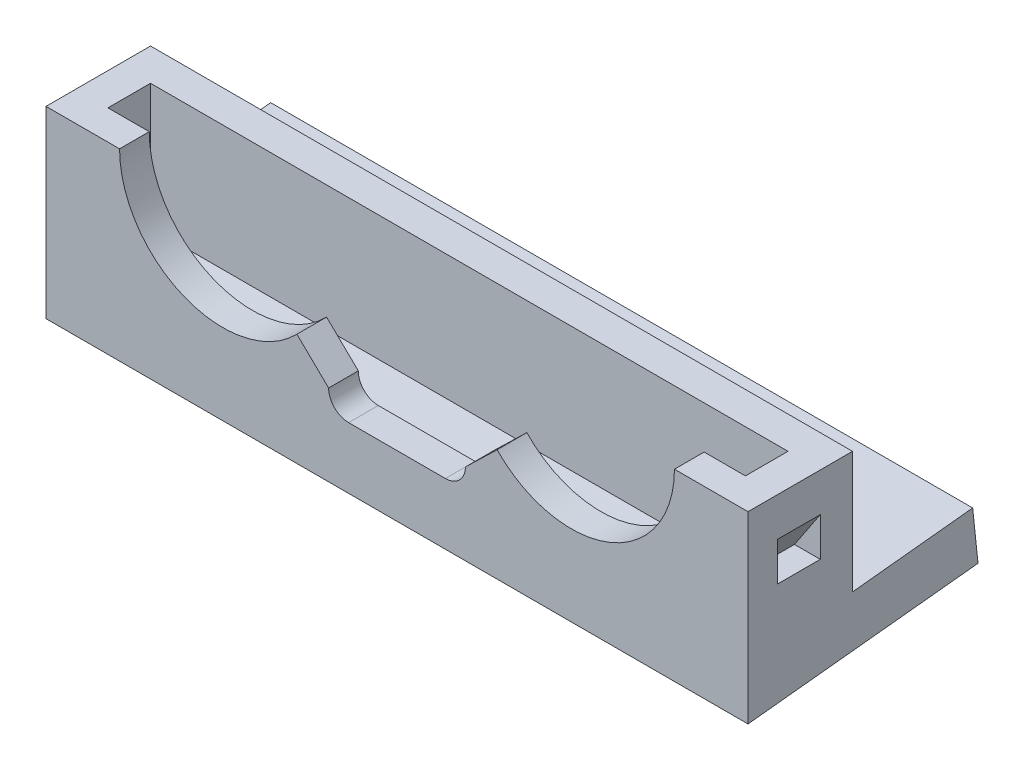
ISO-10303-21;
HEADER;
FILE_DESCRIPTION(('STEP AP214'),'2;1');
FILE_NAME('part.step','',(''),(''),'','','');
FILE_SCHEMA(('AUTOMOTIVE_DESIGN { 1 0 10303 214 1 1 1 1 }'));
ENDSEC;
DATA;
#1=APPLICATION_CONTEXT('core data for automotive mechanical design processes');
#2=APPLICATION_PROTOCOL_DEFINITION('international standard','automotive_design',2000,#1);
#3=PRODUCT_CONTEXT('',#1,'mechanical');
#4=PRODUCT('Part','Part','',(#3));
#5=PRODUCT_RELATED_PRODUCT_CATEGORY('part','',(#4));
#6=PRODUCT_DEFINITION_FORMATION('','',#4);
#7=PRODUCT_DEFINITION_CONTEXT('part definition',#1,'design');
#8=PRODUCT_DEFINITION('design','',#6,#7);
#9=PRODUCT_DEFINITION_SHAPE('','',#8);
#10=(LENGTH_UNIT() NAMED_UNIT(*) SI_UNIT(.MILLI.,.METRE.));
#11=(NAMED_UNIT(*) PLANE_ANGLE_UNIT() SI_UNIT($,.RADIAN.));
#12=(NAMED_UNIT(*) SI_UNIT($,.STERADIAN.) SOLID_ANGLE_UNIT());
#13=UNCERTAINTY_MEASURE_WITH_UNIT(LENGTH_MEASURE(1.E-05),#10,'distance_accuracy_value','');
#14=(GEOMETRIC_REPRESENTATION_CONTEXT(3) GLOBAL_UNCERTAINTY_ASSIGNED_CONTEXT((#13)) GLOBAL_UNIT_ASSIGNED_CONTEXT((#10,
#11,#12)) REPRESENTATION_CONTEXT('',''));
#15=CARTESIAN_POINT('',(0.,0.,0.));
#16=DIRECTION('',(0.,0.,1.));
#17=DIRECTION('',(1.,0.,0.));
#18=AXIS2_PLACEMENT_3D('',#15,#16,#17);
#19=CARTESIAN_POINT('',(-27.2,4.,8.));
#20=DIRECTION('',(1.,0.,0.));
#21=DIRECTION('',(0.,0.,-1.));
#22=AXIS2_PLACEMENT_3D('',#19,#20,#21);
#23=PLANE('',#22);
#24=DIRECTION('',(0.,-0.104528463267646,0.994521895368274));
#25=VECTOR('',#24,1.);
#26=CARTESIAN_POINT('',(-27.2,0.,10.3));
#27=LINE('',#26,#25);
#28=CARTESIAN_POINT('',(-27.2,1.87321147019228,-7.52241662724075));
#29=VERTEX_POINT('',#28);
#30=CARTESIAN_POINT('',(-27.2,0.,10.3));
#31=VERTEX_POINT('',#30);
#32=EDGE_CURVE('E197',#29,#31,#27,.T.);
#33=ORIENTED_EDGE('',*,*,#32,.T.);
#34=DIRECTION('',(0.,-1.,0.));
#35=VECTOR('',#34,1.);
#36=CARTESIAN_POINT('',(-27.2,0.,10.3));
#37=LINE('',#36,#35);
#38=CARTESIAN_POINT('',(-27.2,14.25,10.3));
#39=VERTEX_POINT('',#38);
#40=EDGE_CURVE('E202',#39,#31,#37,.T.);
#41=ORIENTED_EDGE('',*,*,#40,.F.);
#42=DIRECTION('',(0.,0.,-1.));
#43=VECTOR('',#42,1.);
#44=CARTESIAN_POINT('',(-27.2,14.25,8.));
#45=LINE('',#44,#43);
#46=CARTESIAN_POINT('',(-27.2,14.25,2.2));
#47=VERTEX_POINT('',#46);
#48=EDGE_CURVE('E318',#39,#47,#45,.T.);
#49=ORIENTED_EDGE('',*,*,#48,.T.);
#50=DIRECTION('',(0.,1.,0.));
#51=VECTOR('',#50,1.);
#52=CARTESIAN_POINT('',(-27.2,14.25,2.2));
#53=LINE('',#52,#51);
#54=CARTESIAN_POINT('',(-27.2,4.81536914799488,2.2));
#55=VERTEX_POINT('',#54);
#56=EDGE_CURVE('E532',#55,#47,#53,.T.);
#57=ORIENTED_EDGE('',*,*,#56,.F.);
#58=DIRECTION('',(0.,0.104528463267646,-0.994521895368274));
#59=VECTOR('',#58,1.);
#60=CARTESIAN_POINT('',(-27.2,5.79392458575725,-7.11033307353322));
#61=LINE('',#60,#59);
#62=CARTESIAN_POINT('',(-27.2,5.79392458575725,-7.11033307353322));
#63=VERTEX_POINT('',#62);
#64=EDGE_CURVE('E448',#55,#63,#61,.T.);
#65=ORIENTED_EDGE('',*,*,#64,.T.);
#66=DIRECTION('',(0.,-0.994521895368274,-0.104528463267646));
#67=VECTOR('',#66,1.);
#68=CARTESIAN_POINT('',(-27.2,1.87321147019228,-7.52241662724075));
#69=LINE('',#68,#67);
#70=EDGE_CURVE('E204',#63,#29,#69,.T.);
#71=ORIENTED_EDGE('',*,*,#70,.T.);
#72=EDGE_LOOP('',(#33,#41,#49,#57,#65,#71));
#73=FACE_BOUND('',#72,.T.);
#74=DIRECTION('',(0.,-1.,0.));
#75=VECTOR('',#74,1.);
#76=CARTESIAN_POINT('',(-27.2,11.25,8.));
#77=LINE('',#76,#75);
#78=CARTESIAN_POINT('',(-27.2,11.25,8.));
#79=VERTEX_POINT('',#78);
#80=CARTESIAN_POINT('',(-27.2,8.25,8.));
#81=VERTEX_POINT('',#80);
#82=EDGE_CURVE('E473',#79,#81,#77,.T.);
#83=ORIENTED_EDGE('',*,*,#82,.T.);
#84=DIRECTION('',(0.,0.,-1.));
#85=VECTOR('',#84,1.);
#86=CARTESIAN_POINT('',(-27.2,8.25,8.));
#87=LINE('',#86,#85);
#88=CARTESIAN_POINT('',(-27.2,8.25,4.7));
#89=VERTEX_POINT('',#88);
#90=EDGE_CURVE('E486',#81,#89,#87,.T.);
#91=ORIENTED_EDGE('',*,*,#90,.T.);
#92=DIRECTION('',(0.,-1.,0.));
#93=VECTOR('',#92,1.);
#94=CARTESIAN_POINT('',(-27.2,11.25,4.7));
#95=LINE('',#94,#93);
#96=CARTESIAN_POINT('',(-27.2,11.25,4.7));
#97=VERTEX_POINT('',#96);
#98=EDGE_CURVE('E481',#97,#89,#95,.T.);
#99=ORIENTED_EDGE('',*,*,#98,.F.);
#100=DIRECTION('',(0.,0.,-1.));
#101=VECTOR('',#100,1.);
#102=CARTESIAN_POINT('',(-27.2,11.25,8.));
#103=LINE('',#102,#101);
#104=EDGE_CURVE('E489',#79,#97,#103,.T.);
#105=ORIENTED_EDGE('',*,*,#104,.F.);
#106=EDGE_LOOP('',(#83,#91,#99,#105));
#107=FACE_BOUND('',#106,.T.);
#108=ADVANCED_FACE('F35',(#73,#107),#23,.F.);
#109=CARTESIAN_POINT('',(-27.2,0.,8.));
#110=DIRECTION('',(0.,0.,-1.));
#111=DIRECTION('',(-1.,0.,0.));
#112=AXIS2_PLACEMENT_3D('',#109,#110,#111);
#113=PLANE('',#112);
#114=DIRECTION('',(1.,0.,0.));
#115=VECTOR('',#114,1.);
#116=CARTESIAN_POINT('',(-27.2,4.205764583454,8.));
#117=LINE('',#116,#115);
#118=CARTESIAN_POINT('',(-24.7,4.205764583454,8.));
#119=VERTEX_POINT('',#118);
#120=CARTESIAN_POINT('',(24.7,4.205764583454,8.));
#121=VERTEX_POINT('',#120);
#122=EDGE_CURVE('E58',#119,#121,#117,.T.);
#123=ORIENTED_EDGE('',*,*,#122,.F.);
#124=DIRECTION('',(0.,-1.,0.));
#125=VECTOR('',#124,1.);
#126=CARTESIAN_POINT('',(-24.7,14.25,8.));
#127=LINE('',#126,#125);
#128=CARTESIAN_POINT('',(-24.7,14.25,8.));
#129=VERTEX_POINT('',#128);
#130=EDGE_CURVE('E526',#129,#119,#127,.T.);
#131=ORIENTED_EDGE('',*,*,#130,.F.);
#132=DIRECTION('',(-1.,0.,0.));
#133=VECTOR('',#132,1.);
#134=CARTESIAN_POINT('',(-27.2,14.25,8.));
#135=LINE('',#134,#133);
#136=CARTESIAN_POINT('',(-21.5,14.25,8.));
#137=VERTEX_POINT('',#136);
#138=EDGE_CURVE('E255',#137,#129,#135,.T.);
#139=ORIENTED_EDGE('',*,*,#138,.F.);
#140=CARTESIAN_POINT('',(-13.5,14.25,8.));
#141=DIRECTION('',(0.,0.,-1.));
#142=DIRECTION('',(-1.,0.,0.));
#143=AXIS2_PLACEMENT_3D('',#140,#141,#142);
#144=CIRCLE('',#143,8.);
#145=CARTESIAN_POINT('',(-7.75626648161275,8.68138030839285,8.));
#146=VERTEX_POINT('',#145);
#147=EDGE_CURVE('E242',#146,#137,#144,.T.);
#148=ORIENTED_EDGE('',*,*,#147,.F.);
#149=DIRECTION('',(-0.717966689798405,0.696077461450894,0.));
#150=VECTOR('',#149,1.);
#151=CARTESIAN_POINT('',(-13.4404373574563,14.1922532916802,8.));
#152=LINE('',#151,#150);
#153=CARTESIAN_POINT('',(-5.3,6.3,8.));
#154=VERTEX_POINT('',#153);
#155=EDGE_CURVE('E251',#154,#146,#152,.T.);
#156=ORIENTED_EDGE('',*,*,#155,.F.);
#157=CARTESIAN_POINT('',(-3.75,6.3,8.));
#158=DIRECTION('',(0.,0.,-1.));
#159=DIRECTION('',(-1.,0.,0.));
#160=AXIS2_PLACEMENT_3D('',#157,#158,#159);
#161=CIRCLE('',#160,1.55);
#162=CARTESIAN_POINT('',(-3.75,4.75,8.));
#163=VERTEX_POINT('',#162);
#164=EDGE_CURVE('E224',#163,#154,#161,.T.);
#165=ORIENTED_EDGE('',*,*,#164,.F.);
#166=DIRECTION('',(-1.,0.,0.));
#167=VECTOR('',#166,1.);
#168=CARTESIAN_POINT('',(-27.2,4.75,8.));
#169=LINE('',#168,#167);
#170=CARTESIAN_POINT('',(3.75,4.75,8.));
#171=VERTEX_POINT('',#170);
#172=EDGE_CURVE('E272',#171,#163,#169,.T.);
#173=ORIENTED_EDGE('',*,*,#172,.F.);
#174=CARTESIAN_POINT('',(3.75,6.3,8.));
#175=DIRECTION('',(0.,0.,-1.));
#176=DIRECTION('',(-1.,0.,0.));
#177=AXIS2_PLACEMENT_3D('',#174,#175,#176);
#178=CIRCLE('',#177,1.55);
#179=CARTESIAN_POINT('',(5.3,6.3,8.));
#180=VERTEX_POINT('',#179);
#181=EDGE_CURVE('E275',#180,#171,#178,.T.);
#182=ORIENTED_EDGE('',*,*,#181,.F.);
#183=DIRECTION('',(-0.717966689798406,-0.696077461450893,0.));
#184=VECTOR('',#183,1.);
#185=CARTESIAN_POINT('',(-14.601466163252,-12.9947141460797,8.));
#186=LINE('',#185,#184);
#187=CARTESIAN_POINT('',(7.75626648161275,8.68138030839285,8.));
#188=VERTEX_POINT('',#187);
#189=EDGE_CURVE('E309',#188,#180,#186,.T.);
#190=ORIENTED_EDGE('',*,*,#189,.F.);
#191=CARTESIAN_POINT('',(13.5,14.25,8.));
#192=DIRECTION('',(0.,0.,-1.));
#193=DIRECTION('',(-1.,0.,0.));
#194=AXIS2_PLACEMENT_3D('',#191,#192,#193);
#195=CIRCLE('',#194,8.00000000000001);
#196=CARTESIAN_POINT('',(21.5,14.25,8.));
#197=VERTEX_POINT('',#196);
#198=EDGE_CURVE('E260',#197,#188,#195,.T.);
#199=ORIENTED_EDGE('',*,*,#198,.F.);
#200=DIRECTION('',(-1.,0.,0.));
#201=VECTOR('',#200,1.);
#202=CARTESIAN_POINT('',(-27.2,14.25,8.));
#203=LINE('',#202,#201);
#204=CARTESIAN_POINT('',(24.7,14.25,8.));
#205=VERTEX_POINT('',#204);
#206=EDGE_CURVE('E312',#205,#197,#203,.T.);
#207=ORIENTED_EDGE('',*,*,#206,.F.);
#208=DIRECTION('',(0.,-1.,0.));
#209=VECTOR('',#208,1.);
#210=CARTESIAN_POINT('',(24.7,14.25,8.));
#211=LINE('',#210,#209);
#212=EDGE_CURVE('E521',#205,#121,#211,.T.);
#213=ORIENTED_EDGE('',*,*,#212,.T.);
#214=EDGE_LOOP('',(#123,#131,#139,#148,#156,#165,#173,#182,#190,#199,#207,#213));
#215=FACE_BOUND('',#214,.T.);
#216=ADVANCED_FACE('F249',(#215),#113,.T.);
#217=CARTESIAN_POINT('',(-27.2,14.25,4.7));
#218=DIRECTION('',(0.,0.,1.));
#219=DIRECTION('',(0.,-1.,0.));
#220=AXIS2_PLACEMENT_3D('',#217,#218,#219);
#221=PLANE('',#220);
#222=DIRECTION('',(-1.,0.,0.));
#223=VECTOR('',#222,1.);
#224=CARTESIAN_POINT('',(-27.2,4.55260855983071,4.7));
#225=LINE('',#224,#223);
#226=CARTESIAN_POINT('',(24.7,4.55260855983071,4.7));
#227=VERTEX_POINT('',#226);
#228=CARTESIAN_POINT('',(-24.7,4.55260855983071,4.7));
#229=VERTEX_POINT('',#228);
#230=EDGE_CURVE('E459',#227,#229,#225,.T.);
#231=ORIENTED_EDGE('',*,*,#230,.F.);
#232=DIRECTION('',(0.,-1.,0.));
#233=VECTOR('',#232,1.);
#234=CARTESIAN_POINT('',(24.7,14.25,4.7));
#235=LINE('',#234,#233);
#236=CARTESIAN_POINT('',(24.7,14.25,4.7));
#237=VERTEX_POINT('',#236);
#238=EDGE_CURVE('E518',#237,#227,#235,.T.);
#239=ORIENTED_EDGE('',*,*,#238,.F.);
#240=DIRECTION('',(1.,0.,0.));
#241=VECTOR('',#240,1.);
#242=CARTESIAN_POINT('',(-27.2,14.25,4.7));
#243=LINE('',#242,#241);
#244=CARTESIAN_POINT('',(-24.7,14.25,4.7));
#245=VERTEX_POINT('',#244);
#246=EDGE_CURVE('E536',#245,#237,#243,.T.);
#247=ORIENTED_EDGE('',*,*,#246,.F.);
#248=DIRECTION('',(0.,-1.,0.));
#249=VECTOR('',#248,1.);
#250=CARTESIAN_POINT('',(-24.7,14.25,4.7));
#251=LINE('',#250,#249);
#252=EDGE_CURVE('E529',#245,#229,#251,.T.);
#253=ORIENTED_EDGE('',*,*,#252,.T.);
#254=EDGE_LOOP('',(#231,#239,#247,#253));
#255=FACE_BOUND('',#254,.T.);
#256=ADVANCED_FACE('F347',(#255),#221,.T.);
#257=CARTESIAN_POINT('',(27.2,4.,8.));
#258=DIRECTION('',(-1.,0.,0.));
#259=DIRECTION('',(0.,0.,1.));
#260=AXIS2_PLACEMENT_3D('',#257,#258,#259);
#261=PLANE('',#260);
#262=DIRECTION('',(0.,0.,-1.));
#263=VECTOR('',#262,1.);
#264=CARTESIAN_POINT('',(27.2,8.25,8.));
#265=LINE('',#264,#263);
#266=CARTESIAN_POINT('',(27.2,8.25,8.));
#267=VERTEX_POINT('',#266);
#268=CARTESIAN_POINT('',(27.2,8.25,4.7));
#269=VERTEX_POINT('',#268);
#270=EDGE_CURVE('E511',#267,#269,#265,.T.);
#271=ORIENTED_EDGE('',*,*,#270,.F.);
#272=DIRECTION('',(0.,1.,0.));
#273=VECTOR('',#272,1.);
#274=CARTESIAN_POINT('',(27.2,11.25,8.));
#275=LINE('',#274,#273);
#276=CARTESIAN_POINT('',(27.2,11.25,8.));
#277=VERTEX_POINT('',#276);
#278=EDGE_CURVE('E499',#267,#277,#275,.T.);
#279=ORIENTED_EDGE('',*,*,#278,.T.);
#280=DIRECTION('',(0.,0.,-1.));
#281=VECTOR('',#280,1.);
#282=CARTESIAN_POINT('',(27.2,11.25,8.));
#283=LINE('',#282,#281);
#284=CARTESIAN_POINT('',(27.2,11.25,4.7));
#285=VERTEX_POINT('',#284);
#286=EDGE_CURVE('E502',#277,#285,#283,.T.);
#287=ORIENTED_EDGE('',*,*,#286,.T.);
#288=DIRECTION('',(0.,1.,0.));
#289=VECTOR('',#288,1.);
#290=CARTESIAN_POINT('',(27.2,11.25,4.7));
#291=LINE('',#290,#289);
#292=EDGE_CURVE('E497',#269,#285,#291,.T.);
#293=ORIENTED_EDGE('',*,*,#292,.F.);
#294=EDGE_LOOP('',(#271,#279,#287,#293));
#295=FACE_BOUND('',#294,.T.);
#296=DIRECTION('',(0.,-1.,0.));
#297=VECTOR('',#296,1.);
#298=CARTESIAN_POINT('',(27.2,0.,10.3));
#299=LINE('',#298,#297);
#300=CARTESIAN_POINT('',(27.2,14.25,10.3));
#301=VERTEX_POINT('',#300);
#302=CARTESIAN_POINT('',(27.2,0.,10.3));
#303=VERTEX_POINT('',#302);
#304=EDGE_CURVE('E222',#301,#303,#299,.T.);
#305=ORIENTED_EDGE('',*,*,#304,.T.);
#306=DIRECTION('',(0.,-0.104528463267646,0.994521895368274));
#307=VECTOR('',#306,1.);
#308=CARTESIAN_POINT('',(27.2,0.,10.3));
#309=LINE('',#308,#307);
#310=CARTESIAN_POINT('',(27.2,1.87321147019228,-7.52241662724075));
#311=VERTEX_POINT('',#310);
#312=EDGE_CURVE('E212',#311,#303,#309,.T.);
#313=ORIENTED_EDGE('',*,*,#312,.F.);
#314=DIRECTION('',(0.,-0.994521895368274,-0.104528463267646));
#315=VECTOR('',#314,1.);
#316=CARTESIAN_POINT('',(27.2,1.87321147019228,-7.52241662724075));
#317=LINE('',#316,#315);
#318=CARTESIAN_POINT('',(27.2,5.79392458575725,-7.11033307353322));
#319=VERTEX_POINT('',#318);
#320=EDGE_CURVE('E450',#319,#311,#317,.T.);
#321=ORIENTED_EDGE('',*,*,#320,.F.);
#322=DIRECTION('',(0.,0.104528463267646,-0.994521895368274));
#323=VECTOR('',#322,1.);
#324=CARTESIAN_POINT('',(27.2,5.79392458575725,-7.11033307353322));
#325=LINE('',#324,#323);
#326=CARTESIAN_POINT('',(27.2,4.81536914799488,2.2));
#327=VERTEX_POINT('',#326);
#328=EDGE_CURVE('E206',#327,#319,#325,.T.);
#329=ORIENTED_EDGE('',*,*,#328,.F.);
#330=DIRECTION('',(0.,1.,0.));
#331=VECTOR('',#330,1.);
#332=CARTESIAN_POINT('',(27.2,14.25,2.2));
#333=LINE('',#332,#331);
#334=CARTESIAN_POINT('',(27.2,14.25,2.2));
#335=VERTEX_POINT('',#334);
#336=EDGE_CURVE('E50',#327,#335,#333,.T.);
#337=ORIENTED_EDGE('',*,*,#336,.T.);
#338=DIRECTION('',(0.,0.,1.));
#339=VECTOR('',#338,1.);
#340=CARTESIAN_POINT('',(27.2,14.25,8.));
#341=LINE('',#340,#339);
#342=EDGE_CURVE('E314',#335,#301,#341,.T.);
#343=ORIENTED_EDGE('',*,*,#342,.T.);
#344=EDGE_LOOP('',(#305,#313,#321,#329,#337,#343));
#345=FACE_BOUND('',#344,.T.);
#346=ADVANCED_FACE('F37',(#295,#345),#261,.F.);
#347=CARTESIAN_POINT('',(-27.2,0.,10.3));
#348=DIRECTION('',(0.,0.,1.));
#349=DIRECTION('',(1.,0.,0.));
#350=AXIS2_PLACEMENT_3D('',#347,#348,#349);
#351=PLANE('',#350);
#352=ORIENTED_EDGE('',*,*,#40,.T.);
#353=DIRECTION('',(1.,0.,0.));
#354=VECTOR('',#353,1.);
#355=CARTESIAN_POINT('',(-27.2,0.,10.3));
#356=LINE('',#355,#354);
#357=EDGE_CURVE('E209',#31,#303,#356,.T.);
#358=ORIENTED_EDGE('',*,*,#357,.T.);
#359=ORIENTED_EDGE('',*,*,#304,.F.);
#360=DIRECTION('',(1.,0.,0.));
#361=VECTOR('',#360,1.);
#362=CARTESIAN_POINT('',(21.5,14.25,10.3));
#363=LINE('',#362,#361);
#364=CARTESIAN_POINT('',(21.5,14.25,10.3));
#365=VERTEX_POINT('',#364);
#366=EDGE_CURVE('E301',#365,#301,#363,.T.);
#367=ORIENTED_EDGE('',*,*,#366,.F.);
#368=CARTESIAN_POINT('',(13.5,14.25,10.3));
#369=DIRECTION('',(0.,0.,1.));
#370=DIRECTION('',(1.,0.,0.));
#371=AXIS2_PLACEMENT_3D('',#368,#369,#370);
#372=CIRCLE('',#371,8.00000000000001);
#373=CARTESIAN_POINT('',(7.75626648161275,8.68138030839285,10.3));
#374=VERTEX_POINT('',#373);
#375=EDGE_CURVE('E299',#374,#365,#372,.T.);
#376=ORIENTED_EDGE('',*,*,#375,.F.);
#377=DIRECTION('',(0.717966689798406,0.696077461450893,0.));
#378=VECTOR('',#377,1.);
#379=CARTESIAN_POINT('',(5.3,6.3,10.3));
#380=LINE('',#379,#378);
#381=CARTESIAN_POINT('',(5.3,6.3,10.3));
#382=VERTEX_POINT('',#381);
#383=EDGE_CURVE('E296',#382,#374,#380,.T.);
#384=ORIENTED_EDGE('',*,*,#383,.F.);
#385=CARTESIAN_POINT('',(3.75,6.3,10.3));
#386=DIRECTION('',(0.,0.,1.));
#387=DIRECTION('',(1.,0.,0.));
#388=AXIS2_PLACEMENT_3D('',#385,#386,#387);
#389=CIRCLE('',#388,1.55);
#390=CARTESIAN_POINT('',(3.75,4.75,10.3));
#391=VERTEX_POINT('',#390);
#392=EDGE_CURVE('E266',#391,#382,#389,.T.);
#393=ORIENTED_EDGE('',*,*,#392,.F.);
#394=DIRECTION('',(1.,0.,0.));
#395=VECTOR('',#394,1.);
#396=CARTESIAN_POINT('',(-3.75,4.75,10.3));
#397=LINE('',#396,#395);
#398=CARTESIAN_POINT('',(-3.75,4.75,10.3));
#399=VERTEX_POINT('',#398);
#400=EDGE_CURVE('E258',#399,#391,#397,.T.);
#401=ORIENTED_EDGE('',*,*,#400,.F.);
#402=CARTESIAN_POINT('',(-3.75,6.3,10.3));
#403=DIRECTION('',(0.,0.,1.));
#404=DIRECTION('',(1.,0.,0.));
#405=AXIS2_PLACEMENT_3D('',#402,#403,#404);
#406=CIRCLE('',#405,1.55);
#407=CARTESIAN_POINT('',(-5.3,6.3,10.3));
#408=VERTEX_POINT('',#407);
#409=EDGE_CURVE('E256',#408,#399,#406,.T.);
#410=ORIENTED_EDGE('',*,*,#409,.F.);
#411=DIRECTION('',(0.717966689798405,-0.696077461450894,0.));
#412=VECTOR('',#411,1.);
#413=CARTESIAN_POINT('',(-5.3,6.3,10.3));
#414=LINE('',#413,#412);
#415=CARTESIAN_POINT('',(-7.75626648161275,8.68138030839285,10.3));
#416=VERTEX_POINT('',#415);
#417=EDGE_CURVE('E302',#416,#408,#414,.T.);
#418=ORIENTED_EDGE('',*,*,#417,.F.);
#419=CARTESIAN_POINT('',(-13.5,14.25,10.3));
#420=DIRECTION('',(0.,0.,1.));
#421=DIRECTION('',(1.,0.,0.));
#422=AXIS2_PLACEMENT_3D('',#419,#420,#421);
#423=CIRCLE('',#422,8.);
#424=CARTESIAN_POINT('',(-21.5,14.25,10.3));
#425=VERTEX_POINT('',#424);
#426=EDGE_CURVE('E243',#425,#416,#423,.T.);
#427=ORIENTED_EDGE('',*,*,#426,.F.);
#428=DIRECTION('',(1.,0.,0.));
#429=VECTOR('',#428,1.);
#430=CARTESIAN_POINT('',(-35.2426989300947,14.25,10.3));
#431=LINE('',#430,#429);
#432=EDGE_CURVE('E221',#39,#425,#431,.T.);
#433=ORIENTED_EDGE('',*,*,#432,.F.);
#434=EDGE_LOOP('',(#352,#358,#359,#367,#376,#384,#393,#401,#410,#418,#427,#433));
#435=FACE_BOUND('',#434,.T.);
#436=ADVANCED_FACE('F219',(#435),#351,.T.);
#437=CARTESIAN_POINT('',(-3.75,6.3,0.299999999999998));
#438=DIRECTION('',(0.,0.,1.));
#439=DIRECTION('',(1.,0.,0.));
#440=AXIS2_PLACEMENT_3D('',#437,#438,#439);
#441=CYLINDRICAL_SURFACE('',#440,1.55);
#442=ORIENTED_EDGE('',*,*,#164,.T.);
#443=DIRECTION('',(0.,0.,1.));
#444=VECTOR('',#443,1.);
#445=CARTESIAN_POINT('',(-5.3,6.3,0.299999999999998));
#446=LINE('',#445,#444);
#447=EDGE_CURVE('E284',#154,#408,#446,.T.);
#448=ORIENTED_EDGE('',*,*,#447,.T.);
#449=ORIENTED_EDGE('',*,*,#409,.T.);
#450=DIRECTION('',(0.,0.,1.));
#451=VECTOR('',#450,1.);
#452=CARTESIAN_POINT('',(-3.75,4.75,0.299999999999998));
#453=LINE('',#452,#451);
#454=EDGE_CURVE('E269',#163,#399,#453,.T.);
#455=ORIENTED_EDGE('',*,*,#454,.F.);
#456=EDGE_LOOP('',(#442,#448,#449,#455));
#457=FACE_BOUND('',#456,.T.);
#458=ADVANCED_FACE('F283',(#457),#441,.F.);
#459=CARTESIAN_POINT('',(3.75,6.3,0.299999999999998));
#460=DIRECTION('',(0.,0.,1.));
#461=DIRECTION('',(1.,0.,0.));
#462=AXIS2_PLACEMENT_3D('',#459,#460,#461);
#463=CYLINDRICAL_SURFACE('',#462,1.55);
#464=ORIENTED_EDGE('',*,*,#392,.T.);
#465=DIRECTION('',(0.,0.,1.));
#466=VECTOR('',#465,1.);
#467=CARTESIAN_POINT('',(5.3,6.3,0.299999999999998));
#468=LINE('',#467,#466);
#469=EDGE_CURVE('E293',#180,#382,#468,.T.);
#470=ORIENTED_EDGE('',*,*,#469,.F.);
#471=ORIENTED_EDGE('',*,*,#181,.T.);
#472=DIRECTION('',(0.,0.,1.));
#473=VECTOR('',#472,1.);
#474=CARTESIAN_POINT('',(3.75,4.75,0.299999999999998));
#475=LINE('',#474,#473);
#476=EDGE_CURVE('E270',#171,#391,#475,.T.);
#477=ORIENTED_EDGE('',*,*,#476,.T.);
#478=EDGE_LOOP('',(#464,#470,#471,#477));
#479=FACE_BOUND('',#478,.T.);
#480=ADVANCED_FACE('F292',(#479),#463,.F.);
#481=CARTESIAN_POINT('',(-3.75,4.75,0.299999999999998));
#482=DIRECTION('',(0.,-1.,0.));
#483=DIRECTION('',(1.,0.,0.));
#484=AXIS2_PLACEMENT_3D('',#481,#482,#483);
#485=PLANE('',#484);
#486=ORIENTED_EDGE('',*,*,#172,.T.);
#487=ORIENTED_EDGE('',*,*,#454,.T.);
#488=ORIENTED_EDGE('',*,*,#400,.T.);
#489=ORIENTED_EDGE('',*,*,#476,.F.);
#490=EDGE_LOOP('',(#486,#487,#488,#489));
#491=FACE_BOUND('',#490,.T.);
#492=ADVANCED_FACE('F289',(#491),#485,.F.);
#493=CARTESIAN_POINT('',(-13.5,14.25,0.299999999999998));
#494=DIRECTION('',(0.,0.,1.));
#495=DIRECTION('',(1.,0.,0.));
#496=AXIS2_PLACEMENT_3D('',#493,#494,#495);
#497=CYLINDRICAL_SURFACE('',#496,8.);
#498=ORIENTED_EDGE('',*,*,#426,.T.);
#499=DIRECTION('',(0.,0.,1.));
#500=VECTOR('',#499,1.);
#501=CARTESIAN_POINT('',(-7.75626648161275,8.68138030839285,0.299999999999998));
#502=LINE('',#501,#500);
#503=EDGE_CURVE('E43',#416,#146,#502,.F.);
#504=ORIENTED_EDGE('',*,*,#503,.T.);
#505=ORIENTED_EDGE('',*,*,#147,.T.);
#506=DIRECTION('',(0.,0.,1.));
#507=VECTOR('',#506,1.);
#508=CARTESIAN_POINT('',(-21.5,14.25,0.299999999999998));
#509=LINE('',#508,#507);
#510=EDGE_CURVE('E234',#137,#425,#509,.T.);
#511=ORIENTED_EDGE('',*,*,#510,.T.);
#512=EDGE_LOOP('',(#498,#504,#505,#511));
#513=FACE_BOUND('',#512,.T.);
#514=ADVANCED_FACE('F241',(#513),#497,.F.);
#515=CARTESIAN_POINT('',(13.5,14.25,0.299999999999998));
#516=DIRECTION('',(0.,0.,1.));
#517=DIRECTION('',(1.,0.,0.));
#518=AXIS2_PLACEMENT_3D('',#515,#516,#517);
#519=CYLINDRICAL_SURFACE('',#518,8.00000000000001);
#520=ORIENTED_EDGE('',*,*,#375,.T.);
#521=DIRECTION('',(0.,0.,1.));
#522=VECTOR('',#521,1.);
#523=CARTESIAN_POINT('',(21.5,14.25,0.299999999999998));
#524=LINE('',#523,#522);
#525=EDGE_CURVE('E231',#365,#197,#524,.F.);
#526=ORIENTED_EDGE('',*,*,#525,.T.);
#527=ORIENTED_EDGE('',*,*,#198,.T.);
#528=DIRECTION('',(0.,0.,1.));
#529=VECTOR('',#528,1.);
#530=CARTESIAN_POINT('',(7.75626648161275,8.68138030839285,0.299999999999998));
#531=LINE('',#530,#529);
#532=EDGE_CURVE('E216',#188,#374,#531,.T.);
#533=ORIENTED_EDGE('',*,*,#532,.T.);
#534=EDGE_LOOP('',(#520,#526,#527,#533));
#535=FACE_BOUND('',#534,.T.);
#536=ADVANCED_FACE('F324',(#535),#519,.F.);
#537=CARTESIAN_POINT('',(5.3,6.3,0.299999999999998));
#538=DIRECTION('',(0.696077461450893,-0.717966689798406,0.));
#539=DIRECTION('',(0.717966689798406,0.696077461450893,0.));
#540=AXIS2_PLACEMENT_3D('',#537,#538,#539);
#541=PLANE('',#540);
#542=ORIENTED_EDGE('',*,*,#189,.T.);
#543=ORIENTED_EDGE('',*,*,#469,.T.);
#544=ORIENTED_EDGE('',*,*,#383,.T.);
#545=ORIENTED_EDGE('',*,*,#532,.F.);
#546=EDGE_LOOP('',(#542,#543,#544,#545));
#547=FACE_BOUND('',#546,.T.);
#548=ADVANCED_FACE('F327',(#547),#541,.F.);
#549=CARTESIAN_POINT('',(-35.2426989300947,14.25,0.299999999999998));
#550=DIRECTION('',(0.,-1.,0.));
#551=DIRECTION('',(0.,0.,-1.));
#552=AXIS2_PLACEMENT_3D('',#549,#550,#551);
#553=PLANE('',#552);
#554=ORIENTED_EDGE('',*,*,#432,.T.);
#555=ORIENTED_EDGE('',*,*,#510,.F.);
#556=ORIENTED_EDGE('',*,*,#138,.T.);
#557=DIRECTION('',(0.,0.,-1.));
#558=VECTOR('',#557,1.);
#559=CARTESIAN_POINT('',(-24.7,14.25,4.7));
#560=LINE('',#559,#558);
#561=EDGE_CURVE('E523',#129,#245,#560,.T.);
#562=ORIENTED_EDGE('',*,*,#561,.T.);
#563=ORIENTED_EDGE('',*,*,#246,.T.);
#564=DIRECTION('',(0.,0.,1.));
#565=VECTOR('',#564,1.);
#566=CARTESIAN_POINT('',(24.7,14.25,4.7));
#567=LINE('',#566,#565);
#568=EDGE_CURVE('E516',#237,#205,#567,.T.);
#569=ORIENTED_EDGE('',*,*,#568,.T.);
#570=ORIENTED_EDGE('',*,*,#206,.T.);
#571=ORIENTED_EDGE('',*,*,#525,.F.);
#572=ORIENTED_EDGE('',*,*,#366,.T.);
#573=ORIENTED_EDGE('',*,*,#342,.F.);
#574=DIRECTION('',(1.,0.,0.));
#575=VECTOR('',#574,1.);
#576=CARTESIAN_POINT('',(-27.2,14.25,2.2));
#577=LINE('',#576,#575);
#578=EDGE_CURVE('E534',#47,#335,#577,.T.);
#579=ORIENTED_EDGE('',*,*,#578,.F.);
#580=ORIENTED_EDGE('',*,*,#48,.F.);
#581=EDGE_LOOP('',(#554,#555,#556,#562,#563,#569,#570,#571,#572,#573,#579,#580));
#582=FACE_BOUND('',#581,.T.);
#583=ADVANCED_FACE('F329',(#582),#553,.F.);
#584=CARTESIAN_POINT('',(-5.3,6.3,0.299999999999998));
#585=DIRECTION('',(-0.696077461450894,-0.717966689798405,0.));
#586=DIRECTION('',(0.717966689798405,-0.696077461450894,0.));
#587=AXIS2_PLACEMENT_3D('',#584,#585,#586);
#588=PLANE('',#587);
#589=ORIENTED_EDGE('',*,*,#155,.T.);
#590=ORIENTED_EDGE('',*,*,#503,.F.);
#591=ORIENTED_EDGE('',*,*,#417,.T.);
#592=ORIENTED_EDGE('',*,*,#447,.F.);
#593=EDGE_LOOP('',(#589,#590,#591,#592));
#594=FACE_BOUND('',#593,.T.);
#595=ADVANCED_FACE('F335',(#594),#588,.F.);
#596=CARTESIAN_POINT('',(-27.2,14.25,2.2));
#597=DIRECTION('',(0.,0.,-1.));
#598=DIRECTION('',(0.,1.,0.));
#599=AXIS2_PLACEMENT_3D('',#596,#597,#598);
#600=PLANE('',#599);
#601=DIRECTION('',(1.,0.,0.));
#602=VECTOR('',#601,1.);
#603=CARTESIAN_POINT('',(-27.2,4.81536914799488,2.2));
#604=LINE('',#603,#602);
#605=EDGE_CURVE('E467',#55,#327,#604,.T.);
#606=ORIENTED_EDGE('',*,*,#605,.F.);
#607=ORIENTED_EDGE('',*,*,#56,.T.);
#608=ORIENTED_EDGE('',*,*,#578,.T.);
#609=ORIENTED_EDGE('',*,*,#336,.F.);
#610=EDGE_LOOP('',(#606,#607,#608,#609));
#611=FACE_BOUND('',#610,.T.);
#612=ADVANCED_FACE('F360',(#611),#600,.T.);
#613=CARTESIAN_POINT('',(-24.7,14.25,4.7));
#614=DIRECTION('',(-1.,0.,0.));
#615=DIRECTION('',(0.,0.,1.));
#616=AXIS2_PLACEMENT_3D('',#613,#614,#615);
#617=PLANE('',#616);
#618=ORIENTED_EDGE('',*,*,#130,.T.);
#619=DIRECTION('',(0.,0.104528463267646,-0.994521895368274));
#620=VECTOR('',#619,1.);
#621=CARTESIAN_POINT('',(-24.7,4.65856419462627,3.69189947457644));
#622=LINE('',#621,#620);
#623=EDGE_CURVE('E464',#119,#229,#622,.T.);
#624=ORIENTED_EDGE('',*,*,#623,.T.);
#625=ORIENTED_EDGE('',*,*,#252,.F.);
#626=ORIENTED_EDGE('',*,*,#561,.F.);
#627=EDGE_LOOP('',(#618,#624,#625,#626));
#628=FACE_BOUND('',#627,.T.);
#629=ADVANCED_FACE('F365',(#628),#617,.F.);
#630=CARTESIAN_POINT('',(24.7,14.25,4.7));
#631=DIRECTION('',(1.,0.,0.));
#632=DIRECTION('',(0.,0.,-1.));
#633=AXIS2_PLACEMENT_3D('',#630,#631,#632);
#634=PLANE('',#633);
#635=ORIENTED_EDGE('',*,*,#238,.T.);
#636=DIRECTION('',(0.,-0.104528463267646,0.994521895368274));
#637=VECTOR('',#636,1.);
#638=CARTESIAN_POINT('',(24.7,4.65856419462627,3.69189947457644));
#639=LINE('',#638,#637);
#640=EDGE_CURVE('E11',#227,#121,#639,.T.);
#641=ORIENTED_EDGE('',*,*,#640,.T.);
#642=ORIENTED_EDGE('',*,*,#212,.F.);
#643=ORIENTED_EDGE('',*,*,#568,.F.);
#644=EDGE_LOOP('',(#635,#641,#642,#643));
#645=FACE_BOUND('',#644,.T.);
#646=ADVANCED_FACE('F370',(#645),#634,.F.);
#647=CARTESIAN_POINT('',(25.2,8.25,8.));
#648=DIRECTION('',(0.832050294337844,-0.554700196225229,0.));
#649=DIRECTION('',(0.554700196225229,0.832050294337844,0.));
#650=AXIS2_PLACEMENT_3D('',#647,#648,#649);
#651=PLANE('',#650);
#652=DIRECTION('',(-0.554700196225229,-0.832050294337844,0.));
#653=VECTOR('',#652,1.);
#654=CARTESIAN_POINT('',(25.2,8.25,4.7));
#655=LINE('',#654,#653);
#656=CARTESIAN_POINT('',(25.2,8.25,4.7));
#657=VERTEX_POINT('',#656);
#658=EDGE_CURVE('E492',#285,#657,#655,.T.);
#659=ORIENTED_EDGE('',*,*,#658,.F.);
#660=ORIENTED_EDGE('',*,*,#286,.F.);
#661=DIRECTION('',(-0.554700196225229,-0.832050294337844,0.));
#662=VECTOR('',#661,1.);
#663=CARTESIAN_POINT('',(25.2,8.25,8.));
#664=LINE('',#663,#662);
#665=CARTESIAN_POINT('',(25.2,8.25,8.));
#666=VERTEX_POINT('',#665);
#667=EDGE_CURVE('E493',#277,#666,#664,.T.);
#668=ORIENTED_EDGE('',*,*,#667,.T.);
#669=DIRECTION('',(0.,0.,-1.));
#670=VECTOR('',#669,1.);
#671=CARTESIAN_POINT('',(25.2,8.25,8.));
#672=LINE('',#671,#670);
#673=EDGE_CURVE('E513',#666,#657,#672,.T.);
#674=ORIENTED_EDGE('',*,*,#673,.T.);
#675=EDGE_LOOP('',(#659,#660,#668,#674));
#676=FACE_BOUND('',#675,.T.);
#677=ADVANCED_FACE('F379',(#676),#651,.T.);
#678=CARTESIAN_POINT('',(27.2,8.25,8.));
#679=DIRECTION('',(0.,1.,0.));
#680=DIRECTION('',(0.,0.,1.));
#681=AXIS2_PLACEMENT_3D('',#678,#679,#680);
#682=PLANE('',#681);
#683=DIRECTION('',(1.,0.,0.));
#684=VECTOR('',#683,1.);
#685=CARTESIAN_POINT('',(27.2,8.25,4.7));
#686=LINE('',#685,#684);
#687=EDGE_CURVE('E505',#657,#269,#686,.T.);
#688=ORIENTED_EDGE('',*,*,#687,.F.);
#689=ORIENTED_EDGE('',*,*,#673,.F.);
#690=DIRECTION('',(1.,0.,0.));
#691=VECTOR('',#690,1.);
#692=CARTESIAN_POINT('',(27.2,8.25,8.));
#693=LINE('',#692,#691);
#694=EDGE_CURVE('E496',#666,#267,#693,.T.);
#695=ORIENTED_EDGE('',*,*,#694,.T.);
#696=ORIENTED_EDGE('',*,*,#270,.T.);
#697=EDGE_LOOP('',(#688,#689,#695,#696));
#698=FACE_BOUND('',#697,.T.);
#699=ADVANCED_FACE('F383',(#698),#682,.T.);
#700=CARTESIAN_POINT('',(0.,0.,8.));
#701=DIRECTION('',(0.,0.,1.));
#702=DIRECTION('',(1.,0.,0.));
#703=AXIS2_PLACEMENT_3D('',#700,#701,#702);
#704=PLANE('',#703);
#705=ORIENTED_EDGE('',*,*,#667,.F.);
#706=ORIENTED_EDGE('',*,*,#278,.F.);
#707=ORIENTED_EDGE('',*,*,#694,.F.);
#708=EDGE_LOOP('',(#705,#706,#707));
#709=FACE_BOUND('',#708,.T.);
#710=ADVANCED_FACE('F387',(#709),#704,.F.);
#711=CARTESIAN_POINT('',(0.,0.,4.7));
#712=DIRECTION('',(0.,0.,1.));
#713=DIRECTION('',(1.,0.,0.));
#714=AXIS2_PLACEMENT_3D('',#711,#712,#713);
#715=PLANE('',#714);
#716=ORIENTED_EDGE('',*,*,#658,.T.);
#717=ORIENTED_EDGE('',*,*,#687,.T.);
#718=ORIENTED_EDGE('',*,*,#292,.T.);
#719=EDGE_LOOP('',(#716,#717,#718));
#720=FACE_BOUND('',#719,.T.);
#721=ADVANCED_FACE('F389',(#720),#715,.T.);
#722=CARTESIAN_POINT('',(-25.2,8.25,8.));
#723=DIRECTION('',(-0.832050294337844,-0.554700196225229,0.));
#724=DIRECTION('',(0.554700196225229,-0.832050294337844,0.));
#725=AXIS2_PLACEMENT_3D('',#722,#723,#724);
#726=PLANE('',#725);
#727=DIRECTION('',(-0.554700196225229,0.832050294337844,0.));
#728=VECTOR('',#727,1.);
#729=CARTESIAN_POINT('',(-25.2,8.25,4.7));
#730=LINE('',#729,#728);
#731=CARTESIAN_POINT('',(-25.2,8.25,4.7));
#732=VERTEX_POINT('',#731);
#733=EDGE_CURVE('E469',#732,#97,#730,.T.);
#734=ORIENTED_EDGE('',*,*,#733,.F.);
#735=DIRECTION('',(0.,0.,-1.));
#736=VECTOR('',#735,1.);
#737=CARTESIAN_POINT('',(-25.2,8.25,8.));
#738=LINE('',#737,#736);
#739=CARTESIAN_POINT('',(-25.2,8.25,8.));
#740=VERTEX_POINT('',#739);
#741=EDGE_CURVE('E479',#740,#732,#738,.T.);
#742=ORIENTED_EDGE('',*,*,#741,.F.);
#743=DIRECTION('',(-0.554700196225229,0.832050294337844,0.));
#744=VECTOR('',#743,1.);
#745=CARTESIAN_POINT('',(-25.2,8.25,8.));
#746=LINE('',#745,#744);
#747=EDGE_CURVE('E470',#740,#79,#746,.T.);
#748=ORIENTED_EDGE('',*,*,#747,.T.);
#749=ORIENTED_EDGE('',*,*,#104,.T.);
#750=EDGE_LOOP('',(#734,#742,#748,#749));
#751=FACE_BOUND('',#750,.T.);
#752=ADVANCED_FACE('F392',(#751),#726,.T.);
#753=CARTESIAN_POINT('',(-27.2,8.25,8.));
#754=DIRECTION('',(0.,1.,0.));
#755=DIRECTION('',(0.,0.,1.));
#756=AXIS2_PLACEMENT_3D('',#753,#754,#755);
#757=PLANE('',#756);
#758=DIRECTION('',(1.,0.,0.));
#759=VECTOR('',#758,1.);
#760=CARTESIAN_POINT('',(-27.2,8.25,4.7));
#761=LINE('',#760,#759);
#762=EDGE_CURVE('E474',#89,#732,#761,.T.);
#763=ORIENTED_EDGE('',*,*,#762,.F.);
#764=ORIENTED_EDGE('',*,*,#90,.F.);
#765=DIRECTION('',(1.,0.,0.));
#766=VECTOR('',#765,1.);
#767=CARTESIAN_POINT('',(-27.2,8.25,8.));
#768=LINE('',#767,#766);
#769=EDGE_CURVE('E477',#81,#740,#768,.T.);
#770=ORIENTED_EDGE('',*,*,#769,.T.);
#771=ORIENTED_EDGE('',*,*,#741,.T.);
#772=EDGE_LOOP('',(#763,#764,#770,#771));
#773=FACE_BOUND('',#772,.T.);
#774=ADVANCED_FACE('F399',(#773),#757,.T.);
#775=CARTESIAN_POINT('',(0.,0.,8.));
#776=DIRECTION('',(0.,0.,-1.));
#777=DIRECTION('',(-1.,0.,0.));
#778=AXIS2_PLACEMENT_3D('',#775,#776,#777);
#779=PLANE('',#778);
#780=ORIENTED_EDGE('',*,*,#747,.F.);
#781=ORIENTED_EDGE('',*,*,#769,.F.);
#782=ORIENTED_EDGE('',*,*,#82,.F.);
#783=EDGE_LOOP('',(#780,#781,#782));
#784=FACE_BOUND('',#783,.T.);
#785=ADVANCED_FACE('F403',(#784),#779,.T.);
#786=CARTESIAN_POINT('',(0.,0.,4.7));
#787=DIRECTION('',(0.,0.,-1.));
#788=DIRECTION('',(-1.,0.,0.));
#789=AXIS2_PLACEMENT_3D('',#786,#787,#788);
#790=PLANE('',#789);
#791=ORIENTED_EDGE('',*,*,#733,.T.);
#792=ORIENTED_EDGE('',*,*,#98,.T.);
#793=ORIENTED_EDGE('',*,*,#762,.T.);
#794=EDGE_LOOP('',(#791,#792,#793));
#795=FACE_BOUND('',#794,.T.);
#796=ADVANCED_FACE('F405',(#795),#790,.F.);
#797=CARTESIAN_POINT('',(27.2,5.79392458575725,-7.11033307353322));
#798=DIRECTION('',(0.,0.994521895368274,0.104528463267646));
#799=DIRECTION('',(0.,-0.104528463267646,0.994521895368274));
#800=AXIS2_PLACEMENT_3D('',#797,#798,#799);
#801=PLANE('',#800);
#802=ORIENTED_EDGE('',*,*,#623,.F.);
#803=ORIENTED_EDGE('',*,*,#122,.T.);
#804=ORIENTED_EDGE('',*,*,#640,.F.);
#805=ORIENTED_EDGE('',*,*,#230,.T.);
#806=EDGE_LOOP('',(#802,#803,#804,#805));
#807=FACE_BOUND('',#806,.T.);
#808=ADVANCED_FACE('F407',(#807),#801,.T.);
#809=CARTESIAN_POINT('',(27.2,0.,10.3));
#810=DIRECTION('',(0.,-0.994521895368274,-0.104528463267646));
#811=DIRECTION('',(0.,0.104528463267646,-0.994521895368274));
#812=AXIS2_PLACEMENT_3D('',#809,#810,#811);
#813=PLANE('',#812);
#814=CARTESIAN_POINT('',(13.5,1.37433961976594,-2.77596802633187));
#815=DIRECTION('',(0.,-0.994521895368274,-0.104528463267646));
#816=DIRECTION('',(0.,0.104528463267646,-0.994521895368274));
#817=AXIS2_PLACEMENT_3D('',#814,#815,#816);
#818=CIRCLE('',#817,2.3);
#819=CARTESIAN_POINT('',(13.5,1.61475508528153,-5.0633683856789));
#820=VERTEX_POINT('',#819);
#821=EDGE_CURVE('E435',#820,#820,#818,.T.);
#822=ORIENTED_EDGE('',*,*,#821,.F.);
#823=EDGE_LOOP('',(#822));
#824=FACE_BOUND('',#823,.T.);
#825=CARTESIAN_POINT('',(-13.5,1.37433961976594,-2.77596802633187));
#826=DIRECTION('',(0.,-0.994521895368274,-0.104528463267646));
#827=DIRECTION('',(0.,0.104528463267646,-0.994521895368274));
#828=AXIS2_PLACEMENT_3D('',#825,#826,#827);
#829=CIRCLE('',#828,2.3);
#830=CARTESIAN_POINT('',(-13.5,1.61475508528153,-5.0633683856789));
#831=VERTEX_POINT('',#830);
#832=EDGE_CURVE('E445',#831,#831,#829,.T.);
#833=ORIENTED_EDGE('',*,*,#832,.F.);
#834=EDGE_LOOP('',(#833));
#835=FACE_BOUND('',#834,.T.);
#836=ORIENTED_EDGE('',*,*,#312,.T.);
#837=ORIENTED_EDGE('',*,*,#357,.F.);
#838=ORIENTED_EDGE('',*,*,#32,.F.);
#839=DIRECTION('',(-1.,0.,0.));
#840=VECTOR('',#839,1.);
#841=CARTESIAN_POINT('',(27.2,1.87321147019228,-7.52241662724075));
#842=LINE('',#841,#840);
#843=EDGE_CURVE('E457',#311,#29,#842,.T.);
#844=ORIENTED_EDGE('',*,*,#843,.F.);
#845=EDGE_LOOP('',(#836,#837,#838,#844));
#846=FACE_BOUND('',#845,.T.);
#847=ADVANCED_FACE('F210',(#824,#835,#846),#813,.T.);
#848=CARTESIAN_POINT('',(27.2,1.87321147019228,-7.52241662724075));
#849=DIRECTION('',(0.,0.104528463267646,-0.994521895368274));
#850=DIRECTION('',(0.,0.994521895368274,0.104528463267646));
#851=AXIS2_PLACEMENT_3D('',#848,#849,#850);
#852=PLANE('',#851);
#853=ORIENTED_EDGE('',*,*,#70,.F.);
#854=DIRECTION('',(-1.,0.,0.));
#855=VECTOR('',#854,1.);
#856=CARTESIAN_POINT('',(27.2,5.79392458575725,-7.11033307353322));
#857=LINE('',#856,#855);
#858=EDGE_CURVE('E454',#319,#63,#857,.T.);
#859=ORIENTED_EDGE('',*,*,#858,.F.);
#860=ORIENTED_EDGE('',*,*,#320,.T.);
#861=ORIENTED_EDGE('',*,*,#843,.T.);
#862=EDGE_LOOP('',(#853,#859,#860,#861));
#863=FACE_BOUND('',#862,.T.);
#864=ADVANCED_FACE('F416',(#863),#852,.T.);
#865=CARTESIAN_POINT('',(13.5,5.29505273533092,-2.36388447262433));
#866=DIRECTION('',(0.,0.994521895368274,0.104528463267646));
#867=DIRECTION('',(0.,-0.104528463267646,0.994521895368274));
#868=AXIS2_PLACEMENT_3D('',#865,#866,#867);
#869=CIRCLE('',#868,2.3);
#870=CARTESIAN_POINT('',(13.5,5.05463726981533,-0.0764841132773033));
#871=VERTEX_POINT('',#870);
#872=EDGE_CURVE('E438',#871,#871,#869,.T.);
#873=ORIENTED_EDGE('',*,*,#872,.F.);
#874=EDGE_LOOP('',(#873));
#875=FACE_BOUND('',#874,.T.);
#876=CARTESIAN_POINT('',(-13.5,5.29505273533092,-2.36388447262433));
#877=DIRECTION('',(0.,0.994521895368274,0.104528463267646));
#878=DIRECTION('',(0.,-0.104528463267646,0.994521895368274));
#879=AXIS2_PLACEMENT_3D('',#876,#877,#878);
#880=CIRCLE('',#879,2.3);
#881=CARTESIAN_POINT('',(-13.5,5.05463726981533,-0.0764841132773015));
#882=VERTEX_POINT('',#881);
#883=EDGE_CURVE('E440',#882,#882,#880,.T.);
#884=ORIENTED_EDGE('',*,*,#883,.F.);
#885=EDGE_LOOP('',(#884));
#886=FACE_BOUND('',#885,.T.);
#887=ORIENTED_EDGE('',*,*,#64,.F.);
#888=ORIENTED_EDGE('',*,*,#605,.T.);
#889=ORIENTED_EDGE('',*,*,#328,.T.);
#890=ORIENTED_EDGE('',*,*,#858,.T.);
#891=EDGE_LOOP('',(#887,#888,#889,#890));
#892=FACE_BOUND('',#891,.T.);
#893=ADVANCED_FACE('F412',(#875,#886,#892),#801,.T.);
#894=CARTESIAN_POINT('',(-13.5,-48.8069383727032,-8.05023287438429));
#895=DIRECTION('',(0.,0.994521895368274,0.104528463267646));
#896=DIRECTION('',(0.,-0.104528463267646,0.994521895368274));
#897=AXIS2_PLACEMENT_3D('',#894,#895,#896);
#898=CYLINDRICAL_SURFACE('',#897,2.3);
#899=ORIENTED_EDGE('',*,*,#832,.T.);
#900=EDGE_LOOP('',(#899));
#901=FACE_BOUND('',#900,.T.);
#902=ORIENTED_EDGE('',*,*,#883,.T.);
#903=EDGE_LOOP('',(#902));
#904=FACE_BOUND('',#903,.T.);
#905=ADVANCED_FACE('F415',(#901,#904),#898,.F.);
#906=CARTESIAN_POINT('',(13.5,-48.8069383727032,-8.05023287438429));
#907=DIRECTION('',(0.,0.994521895368274,0.104528463267646));
#908=DIRECTION('',(0.,-0.104528463267646,0.994521895368274));
#909=AXIS2_PLACEMENT_3D('',#906,#907,#908);
#910=CYLINDRICAL_SURFACE('',#909,2.3);
#911=ORIENTED_EDGE('',*,*,#821,.T.);
#912=EDGE_LOOP('',(#911));
#913=FACE_BOUND('',#912,.T.);
#914=ORIENTED_EDGE('',*,*,#872,.T.);
#915=EDGE_LOOP('',(#914));
#916=FACE_BOUND('',#915,.T.);
#917=ADVANCED_FACE('F426',(#913,#916),#910,.F.);
#918=CLOSED_SHELL('',(#108,#216,#256,#346,#436,#458,#480,#492,#514,#536,#548,#583,#595,#612,
#629,#646,#677,#699,#710,#721,#752,#774,#785,#796,#808,#847,#864,#893,#905,#917));
#919=MANIFOLD_SOLID_BREP('B2',#918);
#920=ADVANCED_BREP_SHAPE_REPRESENTATION('',(#18,#919),#14);
#921=SHAPE_DEFINITION_REPRESENTATION(#9,#920);
ENDSEC;
END-ISO-10303-21;
